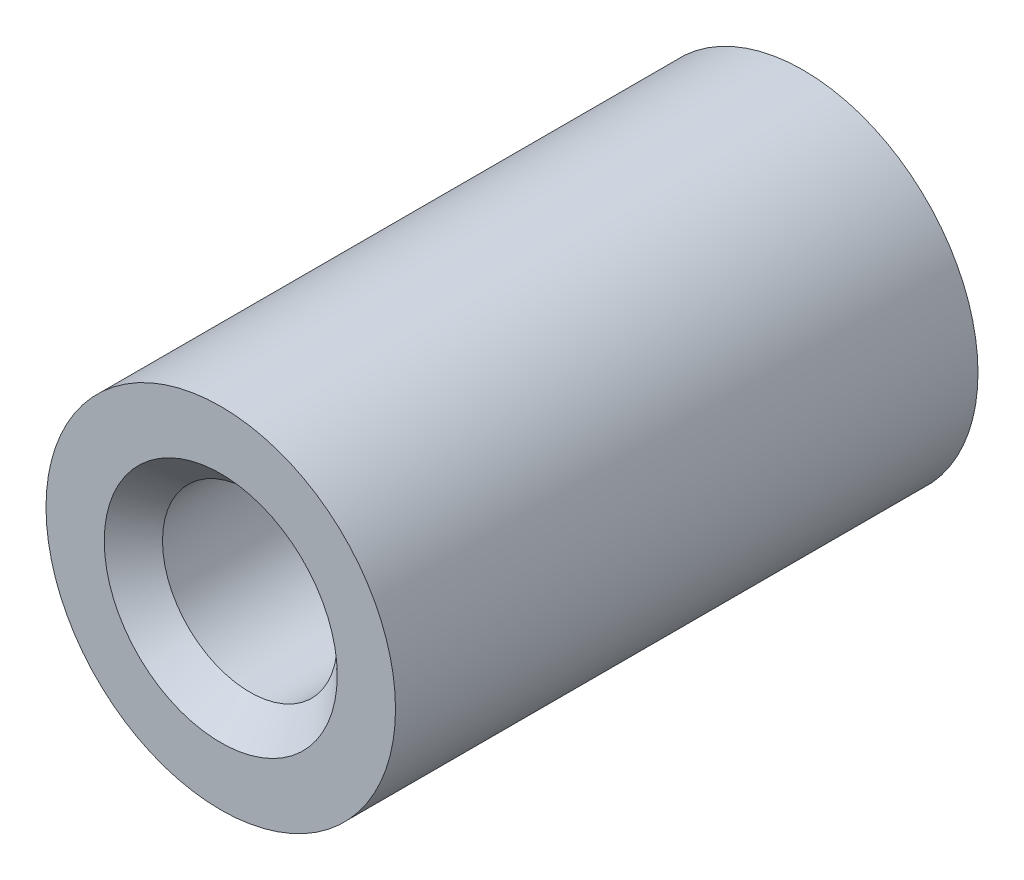
ISO-10303-21;
HEADER;
FILE_DESCRIPTION(('STEP AP214'),'2;1');
FILE_NAME('part.step','',(''),(''),'','','');
FILE_SCHEMA(('AUTOMOTIVE_DESIGN { 1 0 10303 214 1 1 1 1 }'));
ENDSEC;
DATA;
#1=APPLICATION_CONTEXT('core data for automotive mechanical design processes');
#2=APPLICATION_PROTOCOL_DEFINITION('international standard','automotive_design',2000,#1);
#3=PRODUCT_CONTEXT('',#1,'mechanical');
#4=PRODUCT('Part','Part','',(#3));
#5=PRODUCT_RELATED_PRODUCT_CATEGORY('part','',(#4));
#6=PRODUCT_DEFINITION_FORMATION('','',#4);
#7=PRODUCT_DEFINITION_CONTEXT('part definition',#1,'design');
#8=PRODUCT_DEFINITION('design','',#6,#7);
#9=PRODUCT_DEFINITION_SHAPE('','',#8);
#10=(LENGTH_UNIT() NAMED_UNIT(*) SI_UNIT(.MILLI.,.METRE.));
#11=(NAMED_UNIT(*) PLANE_ANGLE_UNIT() SI_UNIT($,.RADIAN.));
#12=(NAMED_UNIT(*) SI_UNIT($,.STERADIAN.) SOLID_ANGLE_UNIT());
#13=UNCERTAINTY_MEASURE_WITH_UNIT(LENGTH_MEASURE(1.E-05),#10,'distance_accuracy_value','');
#14=(GEOMETRIC_REPRESENTATION_CONTEXT(3) GLOBAL_UNCERTAINTY_ASSIGNED_CONTEXT((#13)) GLOBAL_UNIT_ASSIGNED_CONTEXT((#10,
#11,#12)) REPRESENTATION_CONTEXT('',''));
#15=CARTESIAN_POINT('',(0.,0.,0.));
#16=DIRECTION('',(0.,0.,1.));
#17=DIRECTION('',(1.,0.,0.));
#18=AXIS2_PLACEMENT_3D('',#15,#16,#17);
#19=CARTESIAN_POINT('',(0.,0.,10.));
#20=DIRECTION('',(0.,0.,1.));
#21=DIRECTION('',(1.,0.,0.));
#22=AXIS2_PLACEMENT_3D('',#19,#20,#21);
#23=PLANE('',#22);
#24=CARTESIAN_POINT('',(0.,0.,10.));
#25=DIRECTION('',(0.,0.,1.));
#26=DIRECTION('',(1.,0.,0.));
#27=AXIS2_PLACEMENT_3D('',#24,#25,#26);
#28=CIRCLE('',#27,2.);
#29=CARTESIAN_POINT('',(2.,0.,10.));
#30=VERTEX_POINT('',#29);
#31=EDGE_CURVE('E57',#30,#30,#28,.F.);
#32=ORIENTED_EDGE('',*,*,#31,.T.);
#33=EDGE_LOOP('',(#32));
#34=FACE_BOUND('',#33,.T.);
#35=CARTESIAN_POINT('',(0.,0.,10.));
#36=DIRECTION('',(0.,0.,1.));
#37=DIRECTION('',(1.,0.,0.));
#38=AXIS2_PLACEMENT_3D('',#35,#36,#37);
#39=CIRCLE('',#38,3.);
#40=CARTESIAN_POINT('',(3.,0.,10.));
#41=VERTEX_POINT('',#40);
#42=EDGE_CURVE('E68',#41,#41,#39,.T.);
#43=ORIENTED_EDGE('',*,*,#42,.T.);
#44=EDGE_LOOP('',(#43));
#45=FACE_BOUND('',#44,.T.);
#46=ADVANCED_FACE('F43',(#34,#45),#23,.T.);
#47=CARTESIAN_POINT('',(0.,0.,0.));
#48=DIRECTION('',(0.,0.,1.));
#49=DIRECTION('',(1.,0.,0.));
#50=AXIS2_PLACEMENT_3D('',#47,#48,#49);
#51=PLANE('',#50);
#52=CARTESIAN_POINT('',(0.,0.,0.));
#53=DIRECTION('',(0.,0.,1.));
#54=DIRECTION('',(1.,0.,0.));
#55=AXIS2_PLACEMENT_3D('',#52,#53,#54);
#56=CIRCLE('',#55,2.);
#57=CARTESIAN_POINT('',(2.,0.,0.));
#58=VERTEX_POINT('',#57);
#59=EDGE_CURVE('E52',#58,#58,#56,.T.);
#60=ORIENTED_EDGE('',*,*,#59,.T.);
#61=EDGE_LOOP('',(#60));
#62=FACE_BOUND('',#61,.T.);
#63=CARTESIAN_POINT('',(0.,0.,0.));
#64=DIRECTION('',(0.,0.,1.));
#65=DIRECTION('',(1.,0.,0.));
#66=AXIS2_PLACEMENT_3D('',#63,#64,#65);
#67=CIRCLE('',#66,3.);
#68=CARTESIAN_POINT('',(3.,0.,0.));
#69=VERTEX_POINT('',#68);
#70=EDGE_CURVE('E69',#69,#69,#67,.T.);
#71=ORIENTED_EDGE('',*,*,#70,.F.);
#72=EDGE_LOOP('',(#71));
#73=FACE_BOUND('',#72,.T.);
#74=ADVANCED_FACE('F82',(#62,#73),#51,.F.);
#75=CARTESIAN_POINT('',(0.,0.,10.));
#76=DIRECTION('',(0.,0.,-1.));
#77=DIRECTION('',(-1.,0.,0.));
#78=AXIS2_PLACEMENT_3D('',#75,#76,#77);
#79=CYLINDRICAL_SURFACE('',#78,3.);
#80=ORIENTED_EDGE('',*,*,#42,.F.);
#81=EDGE_LOOP('',(#80));
#82=FACE_BOUND('',#81,.T.);
#83=ORIENTED_EDGE('',*,*,#70,.T.);
#84=EDGE_LOOP('',(#83));
#85=FACE_BOUND('',#84,.T.);
#86=ADVANCED_FACE('F78',(#82,#85),#79,.T.);
#87=CARTESIAN_POINT('',(0.,0.,10.));
#88=DIRECTION('',(0.,0.,-1.));
#89=DIRECTION('',(-1.,0.,0.));
#90=AXIS2_PLACEMENT_3D('',#87,#88,#89);
#91=CYLINDRICAL_SURFACE('',#90,1.5);
#92=CARTESIAN_POINT('',(0.,0.,0.500000000000002));
#93=DIRECTION('',(0.,0.,1.));
#94=DIRECTION('',(1.,0.,0.));
#95=AXIS2_PLACEMENT_3D('',#92,#93,#94);
#96=CIRCLE('',#95,1.5);
#97=CARTESIAN_POINT('',(1.5,0.,0.500000000000002));
#98=VERTEX_POINT('',#97);
#99=EDGE_CURVE('E10',#98,#98,#96,.F.);
#100=ORIENTED_EDGE('',*,*,#99,.T.);
#101=EDGE_LOOP('',(#100));
#102=FACE_BOUND('',#101,.T.);
#103=CARTESIAN_POINT('',(0.,0.,9.5));
#104=DIRECTION('',(0.,0.,1.));
#105=DIRECTION('',(1.,0.,0.));
#106=AXIS2_PLACEMENT_3D('',#103,#104,#105);
#107=CIRCLE('',#106,1.5);
#108=CARTESIAN_POINT('',(1.5,0.,9.5));
#109=VERTEX_POINT('',#108);
#110=EDGE_CURVE('E62',#109,#109,#107,.T.);
#111=ORIENTED_EDGE('',*,*,#110,.T.);
#112=EDGE_LOOP('',(#111));
#113=FACE_BOUND('',#112,.T.);
#114=ADVANCED_FACE('F81',(#102,#113),#91,.F.);
#115=CARTESIAN_POINT('',(0.,0.,9.5));
#116=DIRECTION('',(0.,0.,1.));
#117=DIRECTION('',(1.,0.,0.));
#118=AXIS2_PLACEMENT_3D('',#115,#116,#117);
#119=CONICAL_SURFACE('',#118,1.5,0.785398163397449);
#120=ORIENTED_EDGE('',*,*,#31,.F.);
#121=EDGE_LOOP('',(#120));
#122=FACE_BOUND('',#121,.T.);
#123=ORIENTED_EDGE('',*,*,#110,.F.);
#124=EDGE_LOOP('',(#123));
#125=FACE_BOUND('',#124,.T.);
#126=ADVANCED_FACE('F95',(#122,#125),#119,.F.);
#127=CARTESIAN_POINT('',(0.,0.,0.));
#128=DIRECTION('',(0.,0.,-1.));
#129=DIRECTION('',(-1.,0.,0.));
#130=AXIS2_PLACEMENT_3D('',#127,#128,#129);
#131=CONICAL_SURFACE('',#130,2.,0.785398163397447);
#132=ORIENTED_EDGE('',*,*,#99,.F.);
#133=EDGE_LOOP('',(#132));
#134=FACE_BOUND('',#133,.T.);
#135=ORIENTED_EDGE('',*,*,#59,.F.);
#136=EDGE_LOOP('',(#135));
#137=FACE_BOUND('',#136,.T.);
#138=ADVANCED_FACE('F46',(#134,#137),#131,.F.);
#139=CLOSED_SHELL('',(#46,#74,#86,#114,#126,#138));
#140=MANIFOLD_SOLID_BREP('B2',#139);
#141=ADVANCED_BREP_SHAPE_REPRESENTATION('',(#18,#140),#14);
#142=SHAPE_DEFINITION_REPRESENTATION(#9,#141);
ENDSEC;
END-ISO-10303-21;
